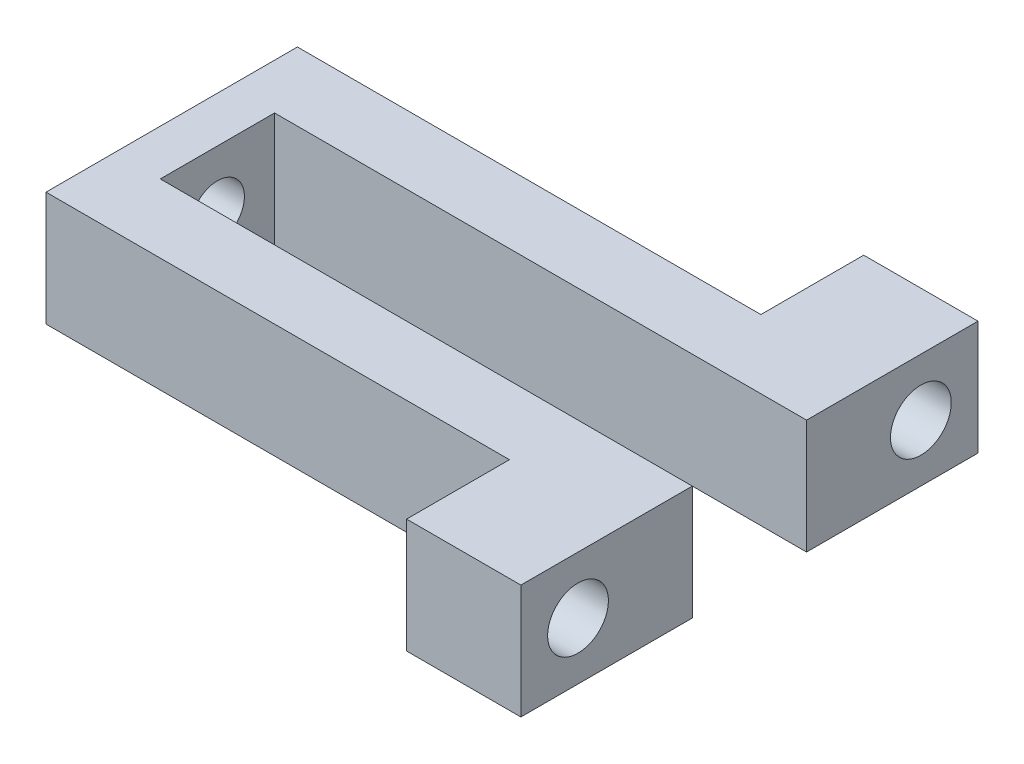
ISO-10303-21;
HEADER;
FILE_DESCRIPTION(('STEP AP214'),'2;1');
FILE_NAME('part.step','',(''),(''),'','','');
FILE_SCHEMA(('AUTOMOTIVE_DESIGN { 1 0 10303 214 1 1 1 1 }'));
ENDSEC;
DATA;
#1=APPLICATION_CONTEXT('core data for automotive mechanical design processes');
#2=APPLICATION_PROTOCOL_DEFINITION('international standard','automotive_design',2000,#1);
#3=PRODUCT_CONTEXT('',#1,'mechanical');
#4=PRODUCT('Part','Part','',(#3));
#5=PRODUCT_RELATED_PRODUCT_CATEGORY('part','',(#4));
#6=PRODUCT_DEFINITION_FORMATION('','',#4);
#7=PRODUCT_DEFINITION_CONTEXT('part definition',#1,'design');
#8=PRODUCT_DEFINITION('design','',#6,#7);
#9=PRODUCT_DEFINITION_SHAPE('','',#8);
#10=(LENGTH_UNIT() NAMED_UNIT(*) SI_UNIT(.MILLI.,.METRE.));
#11=(NAMED_UNIT(*) PLANE_ANGLE_UNIT() SI_UNIT($,.RADIAN.));
#12=(NAMED_UNIT(*) SI_UNIT($,.STERADIAN.) SOLID_ANGLE_UNIT());
#13=UNCERTAINTY_MEASURE_WITH_UNIT(LENGTH_MEASURE(1.E-05),#10,'distance_accuracy_value','');
#14=(GEOMETRIC_REPRESENTATION_CONTEXT(3) GLOBAL_UNCERTAINTY_ASSIGNED_CONTEXT((#13)) GLOBAL_UNIT_ASSIGNED_CONTEXT((#10,
#11,#12)) REPRESENTATION_CONTEXT('',''));
#15=CARTESIAN_POINT('',(0.,0.,0.));
#16=DIRECTION('',(0.,0.,1.));
#17=DIRECTION('',(1.,0.,0.));
#18=AXIS2_PLACEMENT_3D('',#15,#16,#17);
#19=CARTESIAN_POINT('',(19.4,0.,25.4));
#20=DIRECTION('',(1.,0.,0.));
#21=DIRECTION('',(0.,0.,-1.));
#22=AXIS2_PLACEMENT_3D('',#19,#20,#21);
#23=PLANE('',#22);
#24=CARTESIAN_POINT('',(19.4,6.35,19.05));
#25=DIRECTION('',(-1.,0.,0.));
#26=DIRECTION('',(0.,0.,1.));
#27=AXIS2_PLACEMENT_3D('',#24,#25,#26);
#28=CIRCLE('',#27,5.55625);
#29=CARTESIAN_POINT('',(19.4,4.09933030799724,13.97));
#30=VERTEX_POINT('',#29);
#31=CARTESIAN_POINT('',(19.4,8.60066969200276,13.97));
#32=VERTEX_POINT('',#31);
#33=EDGE_CURVE('E11',#30,#32,#28,.T.);
#34=ORIENTED_EDGE('',*,*,#33,.F.);
#35=DIRECTION('',(0.,1.,0.));
#36=VECTOR('',#35,1.);
#37=CARTESIAN_POINT('',(19.4,0.,13.97));
#38=LINE('',#37,#36);
#39=CARTESIAN_POINT('',(19.4,0.,13.97));
#40=VERTEX_POINT('',#39);
#41=EDGE_CURVE('E151',#40,#30,#38,.T.);
#42=ORIENTED_EDGE('',*,*,#41,.F.);
#43=DIRECTION('',(0.,0.,-1.));
#44=VECTOR('',#43,1.);
#45=CARTESIAN_POINT('',(19.4,0.,25.4));
#46=LINE('',#45,#44);
#47=CARTESIAN_POINT('',(19.4,0.,25.4));
#48=VERTEX_POINT('',#47);
#49=EDGE_CURVE('E258',#48,#40,#46,.T.);
#50=ORIENTED_EDGE('',*,*,#49,.F.);
#51=DIRECTION('',(0.,1.,0.));
#52=VECTOR('',#51,1.);
#53=CARTESIAN_POINT('',(19.4,0.,25.4));
#54=LINE('',#53,#52);
#55=CARTESIAN_POINT('',(19.4,12.7,25.4));
#56=VERTEX_POINT('',#55);
#57=EDGE_CURVE('E149',#48,#56,#54,.T.);
#58=ORIENTED_EDGE('',*,*,#57,.T.);
#59=DIRECTION('',(0.,0.,-1.));
#60=VECTOR('',#59,1.);
#61=CARTESIAN_POINT('',(19.4,12.7,25.4));
#62=LINE('',#61,#60);
#63=CARTESIAN_POINT('',(19.4,12.7,13.97));
#64=VERTEX_POINT('',#63);
#65=EDGE_CURVE('E146',#56,#64,#62,.T.);
#66=ORIENTED_EDGE('',*,*,#65,.T.);
#67=EDGE_CURVE('E144',#32,#64,#38,.T.);
#68=ORIENTED_EDGE('',*,*,#67,.F.);
#69=EDGE_LOOP('',(#34,#42,#50,#58,#66,#68));
#70=FACE_BOUND('',#69,.T.);
#71=ADVANCED_FACE('F33',(#70),#23,.F.);
#72=CARTESIAN_POINT('',(32.1,12.7,-25.4));
#73=DIRECTION('',(-1.,0.,0.));
#74=DIRECTION('',(0.,0.,1.));
#75=AXIS2_PLACEMENT_3D('',#72,#73,#74);
#76=PLANE('',#75);
#77=CARTESIAN_POINT('',(32.1,6.35,19.05));
#78=DIRECTION('',(-1.,0.,0.));
#79=DIRECTION('',(0.,0.,1.));
#80=AXIS2_PLACEMENT_3D('',#77,#78,#79);
#81=CIRCLE('',#80,3.3782);
#82=CARTESIAN_POINT('',(32.1,6.35,22.4282));
#83=VERTEX_POINT('',#82);
#84=EDGE_CURVE('E274',#83,#83,#81,.T.);
#85=ORIENTED_EDGE('',*,*,#84,.T.);
#86=EDGE_LOOP('',(#85));
#87=FACE_BOUND('',#86,.T.);
#88=DIRECTION('',(0.,0.,-1.));
#89=VECTOR('',#88,1.);
#90=CARTESIAN_POINT('',(32.1,0.,-25.4));
#91=LINE('',#90,#89);
#92=CARTESIAN_POINT('',(32.1,0.,25.4));
#93=VERTEX_POINT('',#92);
#94=CARTESIAN_POINT('',(32.1,0.,6.34999999999999));
#95=VERTEX_POINT('',#94);
#96=EDGE_CURVE('E227',#93,#95,#91,.T.);
#97=ORIENTED_EDGE('',*,*,#96,.T.);
#98=DIRECTION('',(0.,1.,0.));
#99=VECTOR('',#98,1.);
#100=CARTESIAN_POINT('',(32.1,0.,6.34999999999999));
#101=LINE('',#100,#99);
#102=CARTESIAN_POINT('',(32.1,12.7,6.34999999999999));
#103=VERTEX_POINT('',#102);
#104=EDGE_CURVE('E170',#95,#103,#101,.T.);
#105=ORIENTED_EDGE('',*,*,#104,.T.);
#106=DIRECTION('',(0.,0.,-1.));
#107=VECTOR('',#106,1.);
#108=CARTESIAN_POINT('',(32.1,12.7,-25.4));
#109=LINE('',#108,#107);
#110=CARTESIAN_POINT('',(32.1,12.7,25.4));
#111=VERTEX_POINT('',#110);
#112=EDGE_CURVE('E214',#111,#103,#109,.T.);
#113=ORIENTED_EDGE('',*,*,#112,.F.);
#114=DIRECTION('',(0.,-1.,0.));
#115=VECTOR('',#114,1.);
#116=CARTESIAN_POINT('',(32.1,12.7,25.4));
#117=LINE('',#116,#115);
#118=EDGE_CURVE('E37',#111,#93,#117,.T.);
#119=ORIENTED_EDGE('',*,*,#118,.T.);
#120=EDGE_LOOP('',(#97,#105,#113,#119));
#121=FACE_BOUND('',#120,.T.);
#122=ADVANCED_FACE('F241',(#87,#121),#76,.F.);
#123=CARTESIAN_POINT('',(-32.1,12.7,-25.4));
#124=DIRECTION('',(1.,0.,0.));
#125=DIRECTION('',(0.,0.,-1.));
#126=AXIS2_PLACEMENT_3D('',#123,#124,#125);
#127=PLANE('',#126);
#128=CARTESIAN_POINT('',(-32.1,6.35,0.));
#129=DIRECTION('',(-1.,0.,0.));
#130=DIRECTION('',(0.,0.,1.));
#131=AXIS2_PLACEMENT_3D('',#128,#129,#130);
#132=CIRCLE('',#131,2.99999999999998);
#133=CARTESIAN_POINT('',(-32.1,6.35,2.99999999999998));
#134=VERTEX_POINT('',#133);
#135=EDGE_CURVE('E284',#134,#134,#132,.T.);
#136=ORIENTED_EDGE('',*,*,#135,.F.);
#137=EDGE_LOOP('',(#136));
#138=FACE_BOUND('',#137,.T.);
#139=DIRECTION('',(0.,0.,1.));
#140=VECTOR('',#139,1.);
#141=CARTESIAN_POINT('',(-32.1,0.,-25.4));
#142=LINE('',#141,#140);
#143=CARTESIAN_POINT('',(-32.1,0.,-13.97));
#144=VERTEX_POINT('',#143);
#145=CARTESIAN_POINT('',(-32.1,0.,13.97));
#146=VERTEX_POINT('',#145);
#147=EDGE_CURVE('E221',#144,#146,#142,.T.);
#148=ORIENTED_EDGE('',*,*,#147,.T.);
#149=DIRECTION('',(0.,1.,0.));
#150=VECTOR('',#149,1.);
#151=CARTESIAN_POINT('',(-32.1,0.,13.97));
#152=LINE('',#151,#150);
#153=CARTESIAN_POINT('',(-32.1,12.7,13.97));
#154=VERTEX_POINT('',#153);
#155=EDGE_CURVE('E153',#146,#154,#152,.T.);
#156=ORIENTED_EDGE('',*,*,#155,.T.);
#157=DIRECTION('',(0.,0.,1.));
#158=VECTOR('',#157,1.);
#159=CARTESIAN_POINT('',(-32.1,12.7,-25.4));
#160=LINE('',#159,#158);
#161=CARTESIAN_POINT('',(-32.1,12.7,-13.97));
#162=VERTEX_POINT('',#161);
#163=EDGE_CURVE('E207',#162,#154,#160,.T.);
#164=ORIENTED_EDGE('',*,*,#163,.F.);
#165=DIRECTION('',(0.,1.,0.));
#166=VECTOR('',#165,1.);
#167=CARTESIAN_POINT('',(-32.1,0.,-13.97));
#168=LINE('',#167,#166);
#169=EDGE_CURVE('E166',#144,#162,#168,.T.);
#170=ORIENTED_EDGE('',*,*,#169,.F.);
#171=EDGE_LOOP('',(#148,#156,#164,#170));
#172=FACE_BOUND('',#171,.T.);
#173=ADVANCED_FACE('F35',(#138,#172),#127,.F.);
#174=CARTESIAN_POINT('',(32.1,12.7,25.4));
#175=DIRECTION('',(0.,0.,-1.));
#176=DIRECTION('',(-1.,0.,0.));
#177=AXIS2_PLACEMENT_3D('',#174,#175,#176);
#178=PLANE('',#177);
#179=DIRECTION('',(1.,0.,0.));
#180=VECTOR('',#179,1.);
#181=CARTESIAN_POINT('',(32.1,12.7,25.4));
#182=LINE('',#181,#180);
#183=EDGE_CURVE('E210',#56,#111,#182,.T.);
#184=ORIENTED_EDGE('',*,*,#183,.F.);
#185=ORIENTED_EDGE('',*,*,#57,.F.);
#186=DIRECTION('',(1.,0.,0.));
#187=VECTOR('',#186,1.);
#188=CARTESIAN_POINT('',(32.1,0.,25.4));
#189=LINE('',#188,#187);
#190=EDGE_CURVE('E224',#48,#93,#189,.T.);
#191=ORIENTED_EDGE('',*,*,#190,.T.);
#192=ORIENTED_EDGE('',*,*,#118,.F.);
#193=EDGE_LOOP('',(#184,#185,#191,#192));
#194=FACE_BOUND('',#193,.T.);
#195=ADVANCED_FACE('F257',(#194),#178,.F.);
#196=CARTESIAN_POINT('',(32.1,6.35,-19.05));
#197=DIRECTION('',(-1.,0.,0.));
#198=DIRECTION('',(0.,0.,1.));
#199=AXIS2_PLACEMENT_3D('',#196,#197,#198);
#200=CIRCLE('',#199,3.3782);
#201=CARTESIAN_POINT('',(32.1,6.35,-15.6718));
#202=VERTEX_POINT('',#201);
#203=EDGE_CURVE('E196',#202,#202,#200,.T.);
#204=ORIENTED_EDGE('',*,*,#203,.T.);
#205=EDGE_LOOP('',(#204));
#206=FACE_BOUND('',#205,.T.);
#207=CARTESIAN_POINT('',(32.1,12.7,-6.35000000000001));
#208=VERTEX_POINT('',#207);
#209=CARTESIAN_POINT('',(32.1,12.7,-25.4));
#210=VERTEX_POINT('',#209);
#211=EDGE_CURVE('E213',#208,#210,#109,.T.);
#212=ORIENTED_EDGE('',*,*,#211,.F.);
#213=DIRECTION('',(0.,1.,0.));
#214=VECTOR('',#213,1.);
#215=CARTESIAN_POINT('',(32.1,0.,-6.35000000000001));
#216=LINE('',#215,#214);
#217=CARTESIAN_POINT('',(32.1,0.,-6.35000000000001));
#218=VERTEX_POINT('',#217);
#219=EDGE_CURVE('E191',#218,#208,#216,.T.);
#220=ORIENTED_EDGE('',*,*,#219,.F.);
#221=CARTESIAN_POINT('',(32.1,0.,-25.4));
#222=VERTEX_POINT('',#221);
#223=EDGE_CURVE('E226',#218,#222,#91,.T.);
#224=ORIENTED_EDGE('',*,*,#223,.T.);
#225=DIRECTION('',(0.,-1.,0.));
#226=VECTOR('',#225,1.);
#227=CARTESIAN_POINT('',(32.1,12.7,-25.4));
#228=LINE('',#227,#226);
#229=EDGE_CURVE('E220',#210,#222,#228,.T.);
#230=ORIENTED_EDGE('',*,*,#229,.F.);
#231=EDGE_LOOP('',(#212,#220,#224,#230));
#232=FACE_BOUND('',#231,.T.);
#233=ADVANCED_FACE('F313',(#206,#232),#76,.F.);
#234=CARTESIAN_POINT('',(32.1,12.7,-25.4));
#235=DIRECTION('',(0.,0.,1.));
#236=DIRECTION('',(1.,0.,0.));
#237=AXIS2_PLACEMENT_3D('',#234,#235,#236);
#238=PLANE('',#237);
#239=DIRECTION('',(-1.,0.,0.));
#240=VECTOR('',#239,1.);
#241=CARTESIAN_POINT('',(32.1,0.,-25.4));
#242=LINE('',#241,#240);
#243=CARTESIAN_POINT('',(19.4,0.,-25.4));
#244=VERTEX_POINT('',#243);
#245=EDGE_CURVE('E211',#222,#244,#242,.T.);
#246=ORIENTED_EDGE('',*,*,#245,.T.);
#247=DIRECTION('',(0.,1.,0.));
#248=VECTOR('',#247,1.);
#249=CARTESIAN_POINT('',(19.4,0.,-25.4));
#250=LINE('',#249,#248);
#251=CARTESIAN_POINT('',(19.4,12.7,-25.4));
#252=VERTEX_POINT('',#251);
#253=EDGE_CURVE('E172',#244,#252,#250,.T.);
#254=ORIENTED_EDGE('',*,*,#253,.T.);
#255=DIRECTION('',(-1.,0.,0.));
#256=VECTOR('',#255,1.);
#257=CARTESIAN_POINT('',(32.1,12.7,-25.4));
#258=LINE('',#257,#256);
#259=EDGE_CURVE('E217',#210,#252,#258,.T.);
#260=ORIENTED_EDGE('',*,*,#259,.F.);
#261=ORIENTED_EDGE('',*,*,#229,.T.);
#262=EDGE_LOOP('',(#246,#254,#260,#261));
#263=FACE_BOUND('',#262,.T.);
#264=ADVANCED_FACE('F308',(#263),#238,.F.);
#265=CARTESIAN_POINT('',(0.,12.7,0.));
#266=DIRECTION('',(0.,-1.,0.));
#267=DIRECTION('',(0.,0.,-1.));
#268=AXIS2_PLACEMENT_3D('',#265,#266,#267);
#269=PLANE('',#268);
#270=ORIENTED_EDGE('',*,*,#163,.T.);
#271=DIRECTION('',(-1.,0.,0.));
#272=VECTOR('',#271,1.);
#273=CARTESIAN_POINT('',(-32.1,12.7,13.97));
#274=LINE('',#273,#272);
#275=EDGE_CURVE('E259',#64,#154,#274,.T.);
#276=ORIENTED_EDGE('',*,*,#275,.F.);
#277=ORIENTED_EDGE('',*,*,#65,.F.);
#278=ORIENTED_EDGE('',*,*,#183,.T.);
#279=ORIENTED_EDGE('',*,*,#112,.T.);
#280=DIRECTION('',(1.,0.,0.));
#281=VECTOR('',#280,1.);
#282=CARTESIAN_POINT('',(32.1,12.7,6.34999999999999));
#283=LINE('',#282,#281);
#284=CARTESIAN_POINT('',(-27.02,12.7,6.35));
#285=VERTEX_POINT('',#284);
#286=EDGE_CURVE('E185',#285,#103,#283,.T.);
#287=ORIENTED_EDGE('',*,*,#286,.F.);
#288=DIRECTION('',(0.,0.,1.));
#289=VECTOR('',#288,1.);
#290=CARTESIAN_POINT('',(-27.02,12.7,6.35));
#291=LINE('',#290,#289);
#292=CARTESIAN_POINT('',(-27.02,12.7,-6.35));
#293=VERTEX_POINT('',#292);
#294=EDGE_CURVE('E195',#293,#285,#291,.T.);
#295=ORIENTED_EDGE('',*,*,#294,.F.);
#296=DIRECTION('',(-1.,0.,0.));
#297=VECTOR('',#296,1.);
#298=CARTESIAN_POINT('',(32.1,12.7,-6.35000000000001));
#299=LINE('',#298,#297);
#300=EDGE_CURVE('E192',#208,#293,#299,.T.);
#301=ORIENTED_EDGE('',*,*,#300,.F.);
#302=ORIENTED_EDGE('',*,*,#211,.T.);
#303=ORIENTED_EDGE('',*,*,#259,.T.);
#304=DIRECTION('',(0.,0.,-1.));
#305=VECTOR('',#304,1.);
#306=CARTESIAN_POINT('',(19.4,12.7,-25.4));
#307=LINE('',#306,#305);
#308=CARTESIAN_POINT('',(19.4,12.7,-13.97));
#309=VERTEX_POINT('',#308);
#310=EDGE_CURVE('E163',#309,#252,#307,.T.);
#311=ORIENTED_EDGE('',*,*,#310,.F.);
#312=DIRECTION('',(1.,0.,0.));
#313=VECTOR('',#312,1.);
#314=CARTESIAN_POINT('',(-32.1,12.7,-13.97));
#315=LINE('',#314,#313);
#316=EDGE_CURVE('E167',#162,#309,#315,.T.);
#317=ORIENTED_EDGE('',*,*,#316,.F.);
#318=EDGE_LOOP('',(#270,#276,#277,#278,#279,#287,#295,#301,#302,#303,#311,#317));
#319=FACE_BOUND('',#318,.T.);
#320=ADVANCED_FACE('F254',(#319),#269,.F.);
#321=CARTESIAN_POINT('',(0.,0.,0.));
#322=DIRECTION('',(0.,-1.,0.));
#323=DIRECTION('',(0.,0.,-1.));
#324=AXIS2_PLACEMENT_3D('',#321,#322,#323);
#325=PLANE('',#324);
#326=DIRECTION('',(-1.,0.,0.));
#327=VECTOR('',#326,1.);
#328=CARTESIAN_POINT('',(-32.1,0.,13.97));
#329=LINE('',#328,#327);
#330=EDGE_CURVE('E158',#40,#146,#329,.T.);
#331=ORIENTED_EDGE('',*,*,#330,.T.);
#332=ORIENTED_EDGE('',*,*,#147,.F.);
#333=DIRECTION('',(1.,0.,0.));
#334=VECTOR('',#333,1.);
#335=CARTESIAN_POINT('',(-32.1,0.,-13.97));
#336=LINE('',#335,#334);
#337=CARTESIAN_POINT('',(19.4,0.,-13.97));
#338=VERTEX_POINT('',#337);
#339=EDGE_CURVE('E159',#144,#338,#336,.T.);
#340=ORIENTED_EDGE('',*,*,#339,.T.);
#341=DIRECTION('',(0.,0.,-1.));
#342=VECTOR('',#341,1.);
#343=CARTESIAN_POINT('',(19.4,0.,-25.4));
#344=LINE('',#343,#342);
#345=EDGE_CURVE('E162',#338,#244,#344,.T.);
#346=ORIENTED_EDGE('',*,*,#345,.T.);
#347=ORIENTED_EDGE('',*,*,#245,.F.);
#348=ORIENTED_EDGE('',*,*,#223,.F.);
#349=DIRECTION('',(-1.,0.,0.));
#350=VECTOR('',#349,1.);
#351=CARTESIAN_POINT('',(32.1,0.,-6.35000000000001));
#352=LINE('',#351,#350);
#353=CARTESIAN_POINT('',(-27.02,0.,-6.35));
#354=VERTEX_POINT('',#353);
#355=EDGE_CURVE('E181',#218,#354,#352,.T.);
#356=ORIENTED_EDGE('',*,*,#355,.T.);
#357=DIRECTION('',(0.,0.,1.));
#358=VECTOR('',#357,1.);
#359=CARTESIAN_POINT('',(-27.02,0.,6.35));
#360=LINE('',#359,#358);
#361=CARTESIAN_POINT('',(-27.02,0.,6.35));
#362=VERTEX_POINT('',#361);
#363=EDGE_CURVE('E184',#354,#362,#360,.T.);
#364=ORIENTED_EDGE('',*,*,#363,.T.);
#365=DIRECTION('',(1.,0.,0.));
#366=VECTOR('',#365,1.);
#367=CARTESIAN_POINT('',(32.1,0.,6.34999999999999));
#368=LINE('',#367,#366);
#369=EDGE_CURVE('E188',#362,#95,#368,.T.);
#370=ORIENTED_EDGE('',*,*,#369,.T.);
#371=ORIENTED_EDGE('',*,*,#96,.F.);
#372=ORIENTED_EDGE('',*,*,#190,.F.);
#373=ORIENTED_EDGE('',*,*,#49,.T.);
#374=EDGE_LOOP('',(#331,#332,#340,#346,#347,#348,#356,#364,#370,#371,#372,#373));
#375=FACE_BOUND('',#374,.T.);
#376=ADVANCED_FACE('F247',(#375),#325,.T.);
#377=CARTESIAN_POINT('',(32.1,0.,6.34999999999999));
#378=DIRECTION('',(0.,0.,1.));
#379=DIRECTION('',(1.,0.,0.));
#380=AXIS2_PLACEMENT_3D('',#377,#378,#379);
#381=PLANE('',#380);
#382=ORIENTED_EDGE('',*,*,#286,.T.);
#383=ORIENTED_EDGE('',*,*,#104,.F.);
#384=ORIENTED_EDGE('',*,*,#369,.F.);
#385=DIRECTION('',(0.,1.,0.));
#386=VECTOR('',#385,1.);
#387=CARTESIAN_POINT('',(-27.02,0.,6.35));
#388=LINE('',#387,#386);
#389=EDGE_CURVE('E202',#362,#285,#388,.T.);
#390=ORIENTED_EDGE('',*,*,#389,.T.);
#391=EDGE_LOOP('',(#382,#383,#384,#390));
#392=FACE_BOUND('',#391,.T.);
#393=ADVANCED_FACE('F251',(#392),#381,.F.);
#394=CARTESIAN_POINT('',(-27.02,0.,6.35));
#395=DIRECTION('',(-1.,0.,0.));
#396=DIRECTION('',(0.,0.,1.));
#397=AXIS2_PLACEMENT_3D('',#394,#395,#396);
#398=PLANE('',#397);
#399=CARTESIAN_POINT('',(-27.02,6.35,0.));
#400=DIRECTION('',(-1.,0.,0.));
#401=DIRECTION('',(0.,0.,1.));
#402=AXIS2_PLACEMENT_3D('',#399,#400,#401);
#403=CIRCLE('',#402,2.99999999999998);
#404=CARTESIAN_POINT('',(-27.02,6.35,2.99999999999998));
#405=VERTEX_POINT('',#404);
#406=EDGE_CURVE('E142',#405,#405,#403,.T.);
#407=ORIENTED_EDGE('',*,*,#406,.T.);
#408=EDGE_LOOP('',(#407));
#409=FACE_BOUND('',#408,.T.);
#410=ORIENTED_EDGE('',*,*,#294,.T.);
#411=ORIENTED_EDGE('',*,*,#389,.F.);
#412=ORIENTED_EDGE('',*,*,#363,.F.);
#413=DIRECTION('',(0.,1.,0.));
#414=VECTOR('',#413,1.);
#415=CARTESIAN_POINT('',(-27.02,0.,-6.35));
#416=LINE('',#415,#414);
#417=EDGE_CURVE('E204',#354,#293,#416,.T.);
#418=ORIENTED_EDGE('',*,*,#417,.T.);
#419=EDGE_LOOP('',(#410,#411,#412,#418));
#420=FACE_BOUND('',#419,.T.);
#421=ADVANCED_FACE('F318',(#409,#420),#398,.F.);
#422=CARTESIAN_POINT('',(32.1,0.,-6.35000000000001));
#423=DIRECTION('',(0.,0.,-1.));
#424=DIRECTION('',(-1.,0.,0.));
#425=AXIS2_PLACEMENT_3D('',#422,#423,#424);
#426=PLANE('',#425);
#427=ORIENTED_EDGE('',*,*,#300,.T.);
#428=ORIENTED_EDGE('',*,*,#417,.F.);
#429=ORIENTED_EDGE('',*,*,#355,.F.);
#430=ORIENTED_EDGE('',*,*,#219,.T.);
#431=EDGE_LOOP('',(#427,#428,#429,#430));
#432=FACE_BOUND('',#431,.T.);
#433=ADVANCED_FACE('F316',(#432),#426,.F.);
#434=CARTESIAN_POINT('',(19.4,0.,-25.4));
#435=DIRECTION('',(1.,0.,0.));
#436=DIRECTION('',(0.,0.,-1.));
#437=AXIS2_PLACEMENT_3D('',#434,#435,#436);
#438=PLANE('',#437);
#439=DIRECTION('',(0.,1.,0.));
#440=VECTOR('',#439,1.);
#441=CARTESIAN_POINT('',(19.4,0.,-13.97));
#442=LINE('',#441,#440);
#443=CARTESIAN_POINT('',(19.4,4.09933030799715,-13.97));
#444=VERTEX_POINT('',#443);
#445=EDGE_CURVE('E175',#338,#444,#442,.T.);
#446=ORIENTED_EDGE('',*,*,#445,.T.);
#447=CARTESIAN_POINT('',(19.4,6.35,-19.05));
#448=DIRECTION('',(-1.,0.,0.));
#449=DIRECTION('',(0.,0.,1.));
#450=AXIS2_PLACEMENT_3D('',#447,#448,#449);
#451=CIRCLE('',#450,5.55625);
#452=CARTESIAN_POINT('',(19.4,8.60066969200285,-13.97));
#453=VERTEX_POINT('',#452);
#454=EDGE_CURVE('E272',#453,#444,#451,.T.);
#455=ORIENTED_EDGE('',*,*,#454,.F.);
#456=EDGE_CURVE('E179',#453,#309,#442,.T.);
#457=ORIENTED_EDGE('',*,*,#456,.T.);
#458=ORIENTED_EDGE('',*,*,#310,.T.);
#459=ORIENTED_EDGE('',*,*,#253,.F.);
#460=ORIENTED_EDGE('',*,*,#345,.F.);
#461=EDGE_LOOP('',(#446,#455,#457,#458,#459,#460));
#462=FACE_BOUND('',#461,.T.);
#463=ADVANCED_FACE('F306',(#462),#438,.F.);
#464=CARTESIAN_POINT('',(-32.1,0.,-13.97));
#465=DIRECTION('',(0.,0.,1.));
#466=DIRECTION('',(1.,0.,0.));
#467=AXIS2_PLACEMENT_3D('',#464,#465,#466);
#468=PLANE('',#467);
#469=ORIENTED_EDGE('',*,*,#316,.T.);
#470=ORIENTED_EDGE('',*,*,#456,.F.);
#471=EDGE_CURVE('E178',#444,#453,#442,.T.);
#472=ORIENTED_EDGE('',*,*,#471,.F.);
#473=ORIENTED_EDGE('',*,*,#445,.F.);
#474=ORIENTED_EDGE('',*,*,#339,.F.);
#475=ORIENTED_EDGE('',*,*,#169,.T.);
#476=EDGE_LOOP('',(#469,#470,#472,#473,#474,#475));
#477=FACE_BOUND('',#476,.T.);
#478=ADVANCED_FACE('F301',(#477),#468,.F.);
#479=CARTESIAN_POINT('',(-32.1,0.,13.97));
#480=DIRECTION('',(0.,0.,-1.));
#481=DIRECTION('',(-1.,0.,0.));
#482=AXIS2_PLACEMENT_3D('',#479,#480,#481);
#483=PLANE('',#482);
#484=ORIENTED_EDGE('',*,*,#275,.T.);
#485=ORIENTED_EDGE('',*,*,#155,.F.);
#486=ORIENTED_EDGE('',*,*,#330,.F.);
#487=ORIENTED_EDGE('',*,*,#41,.T.);
#488=EDGE_CURVE('E140',#30,#32,#38,.T.);
#489=ORIENTED_EDGE('',*,*,#488,.T.);
#490=ORIENTED_EDGE('',*,*,#67,.T.);
#491=EDGE_LOOP('',(#484,#485,#486,#487,#489,#490));
#492=FACE_BOUND('',#491,.T.);
#493=ADVANCED_FACE('F152',(#492),#483,.F.);
#494=CARTESIAN_POINT('',(19.4,11.90625,-19.05));
#495=DIRECTION('',(-1.,0.,0.));
#496=DIRECTION('',(0.,0.,1.));
#497=AXIS2_PLACEMENT_3D('',#494,#495,#496);
#498=PLANE('',#497);
#499=EDGE_CURVE('E54',#444,#453,#451,.T.);
#500=ORIENTED_EDGE('',*,*,#499,.F.);
#501=ORIENTED_EDGE('',*,*,#471,.T.);
#502=EDGE_LOOP('',(#500,#501));
#503=FACE_BOUND('',#502,.T.);
#504=ADVANCED_FACE('F344',(#503),#498,.F.);
#505=CARTESIAN_POINT('',(19.4,6.35,-19.05));
#506=DIRECTION('',(-1.,0.,0.));
#507=DIRECTION('',(0.,0.,1.));
#508=AXIS2_PLACEMENT_3D('',#505,#506,#507);
#509=CYLINDRICAL_SURFACE('',#508,3.3782);
#510=ORIENTED_EDGE('',*,*,#203,.F.);
#511=EDGE_LOOP('',(#510));
#512=FACE_BOUND('',#511,.T.);
#513=CARTESIAN_POINT('',(25.75,6.35,-19.05));
#514=DIRECTION('',(-1.,0.,0.));
#515=DIRECTION('',(0.,0.,1.));
#516=AXIS2_PLACEMENT_3D('',#513,#514,#515);
#517=CIRCLE('',#516,3.3782);
#518=CARTESIAN_POINT('',(25.75,6.35,-15.6718));
#519=VERTEX_POINT('',#518);
#520=EDGE_CURVE('E266',#519,#519,#517,.T.);
#521=ORIENTED_EDGE('',*,*,#520,.T.);
#522=EDGE_LOOP('',(#521));
#523=FACE_BOUND('',#522,.T.);
#524=ADVANCED_FACE('F348',(#512,#523),#509,.F.);
#525=CARTESIAN_POINT('',(25.75,9.7282,-19.05));
#526=DIRECTION('',(1.,0.,0.));
#527=DIRECTION('',(0.,0.,-1.));
#528=AXIS2_PLACEMENT_3D('',#525,#526,#527);
#529=PLANE('',#528);
#530=ORIENTED_EDGE('',*,*,#520,.F.);
#531=EDGE_LOOP('',(#530));
#532=FACE_BOUND('',#531,.T.);
#533=CARTESIAN_POINT('',(25.75,6.35,-19.05));
#534=DIRECTION('',(-1.,0.,0.));
#535=DIRECTION('',(0.,0.,1.));
#536=AXIS2_PLACEMENT_3D('',#533,#534,#535);
#537=CIRCLE('',#536,5.55625);
#538=CARTESIAN_POINT('',(25.75,6.35,-13.49375));
#539=VERTEX_POINT('',#538);
#540=EDGE_CURVE('E269',#539,#539,#537,.T.);
#541=ORIENTED_EDGE('',*,*,#540,.T.);
#542=EDGE_LOOP('',(#541));
#543=FACE_BOUND('',#542,.T.);
#544=ADVANCED_FACE('F353',(#532,#543),#529,.F.);
#545=CARTESIAN_POINT('',(19.4,6.35,-19.05));
#546=DIRECTION('',(-1.,0.,0.));
#547=DIRECTION('',(0.,0.,1.));
#548=AXIS2_PLACEMENT_3D('',#545,#546,#547);
#549=CYLINDRICAL_SURFACE('',#548,5.55625);
#550=ORIENTED_EDGE('',*,*,#540,.F.);
#551=EDGE_LOOP('',(#550));
#552=FACE_BOUND('',#551,.T.);
#553=ORIENTED_EDGE('',*,*,#454,.T.);
#554=ORIENTED_EDGE('',*,*,#499,.T.);
#555=EDGE_LOOP('',(#553,#554));
#556=FACE_BOUND('',#555,.T.);
#557=ADVANCED_FACE('F359',(#552,#556),#549,.F.);
#558=CARTESIAN_POINT('',(19.4,11.90625,19.05));
#559=DIRECTION('',(-1.,0.,0.));
#560=DIRECTION('',(0.,0.,1.));
#561=AXIS2_PLACEMENT_3D('',#558,#559,#560);
#562=PLANE('',#561);
#563=EDGE_CURVE('E43',#32,#30,#28,.T.);
#564=ORIENTED_EDGE('',*,*,#563,.F.);
#565=ORIENTED_EDGE('',*,*,#488,.F.);
#566=EDGE_LOOP('',(#564,#565));
#567=FACE_BOUND('',#566,.T.);
#568=ADVANCED_FACE('F138',(#567),#562,.F.);
#569=CARTESIAN_POINT('',(19.4,6.35,19.05));
#570=DIRECTION('',(-1.,0.,0.));
#571=DIRECTION('',(0.,0.,1.));
#572=AXIS2_PLACEMENT_3D('',#569,#570,#571);
#573=CYLINDRICAL_SURFACE('',#572,3.3782);
#574=ORIENTED_EDGE('',*,*,#84,.F.);
#575=EDGE_LOOP('',(#574));
#576=FACE_BOUND('',#575,.T.);
#577=CARTESIAN_POINT('',(25.75,6.35,19.05));
#578=DIRECTION('',(-1.,0.,0.));
#579=DIRECTION('',(0.,0.,1.));
#580=AXIS2_PLACEMENT_3D('',#577,#578,#579);
#581=CIRCLE('',#580,3.3782);
#582=CARTESIAN_POINT('',(25.75,6.35,22.4282));
#583=VERTEX_POINT('',#582);
#584=EDGE_CURVE('E277',#583,#583,#581,.T.);
#585=ORIENTED_EDGE('',*,*,#584,.T.);
#586=EDGE_LOOP('',(#585));
#587=FACE_BOUND('',#586,.T.);
#588=ADVANCED_FACE('F366',(#576,#587),#573,.F.);
#589=CARTESIAN_POINT('',(25.75,9.7282,19.05));
#590=DIRECTION('',(1.,0.,0.));
#591=DIRECTION('',(0.,0.,-1.));
#592=AXIS2_PLACEMENT_3D('',#589,#590,#591);
#593=PLANE('',#592);
#594=ORIENTED_EDGE('',*,*,#584,.F.);
#595=EDGE_LOOP('',(#594));
#596=FACE_BOUND('',#595,.T.);
#597=CARTESIAN_POINT('',(25.75,6.35,19.05));
#598=DIRECTION('',(-1.,0.,0.));
#599=DIRECTION('',(0.,0.,1.));
#600=AXIS2_PLACEMENT_3D('',#597,#598,#599);
#601=CIRCLE('',#600,5.55625);
#602=CARTESIAN_POINT('',(25.75,6.35,24.60625));
#603=VERTEX_POINT('',#602);
#604=EDGE_CURVE('E141',#603,#603,#601,.T.);
#605=ORIENTED_EDGE('',*,*,#604,.T.);
#606=EDGE_LOOP('',(#605));
#607=FACE_BOUND('',#606,.T.);
#608=ADVANCED_FACE('F369',(#596,#607),#593,.F.);
#609=CARTESIAN_POINT('',(19.4,6.35,19.05));
#610=DIRECTION('',(-1.,0.,0.));
#611=DIRECTION('',(0.,0.,1.));
#612=AXIS2_PLACEMENT_3D('',#609,#610,#611);
#613=CYLINDRICAL_SURFACE('',#612,5.55625);
#614=ORIENTED_EDGE('',*,*,#604,.F.);
#615=EDGE_LOOP('',(#614));
#616=FACE_BOUND('',#615,.T.);
#617=ORIENTED_EDGE('',*,*,#563,.T.);
#618=ORIENTED_EDGE('',*,*,#33,.T.);
#619=EDGE_LOOP('',(#617,#618));
#620=FACE_BOUND('',#619,.T.);
#621=ADVANCED_FACE('F132',(#616,#620),#613,.F.);
#622=CARTESIAN_POINT('',(-32.1,6.35,0.));
#623=DIRECTION('',(-1.,0.,0.));
#624=DIRECTION('',(0.,0.,1.));
#625=AXIS2_PLACEMENT_3D('',#622,#623,#624);
#626=CYLINDRICAL_SURFACE('',#625,2.99999999999998);
#627=ORIENTED_EDGE('',*,*,#135,.T.);
#628=EDGE_LOOP('',(#627));
#629=FACE_BOUND('',#628,.T.);
#630=ORIENTED_EDGE('',*,*,#406,.F.);
#631=EDGE_LOOP('',(#630));
#632=FACE_BOUND('',#631,.T.);
#633=ADVANCED_FACE('F288',(#629,#632),#626,.F.);
#634=CLOSED_SHELL('',(#71,#122,#173,#195,#233,#264,#320,#376,#393,#421,#433,#463,#478,#493,#504,
#524,#544,#557,#568,#588,#608,#621,#633));
#635=MANIFOLD_SOLID_BREP('B2',#634);
#636=ADVANCED_BREP_SHAPE_REPRESENTATION('',(#18,#635),#14);
#637=SHAPE_DEFINITION_REPRESENTATION(#9,#636);
ENDSEC;
END-ISO-10303-21;
